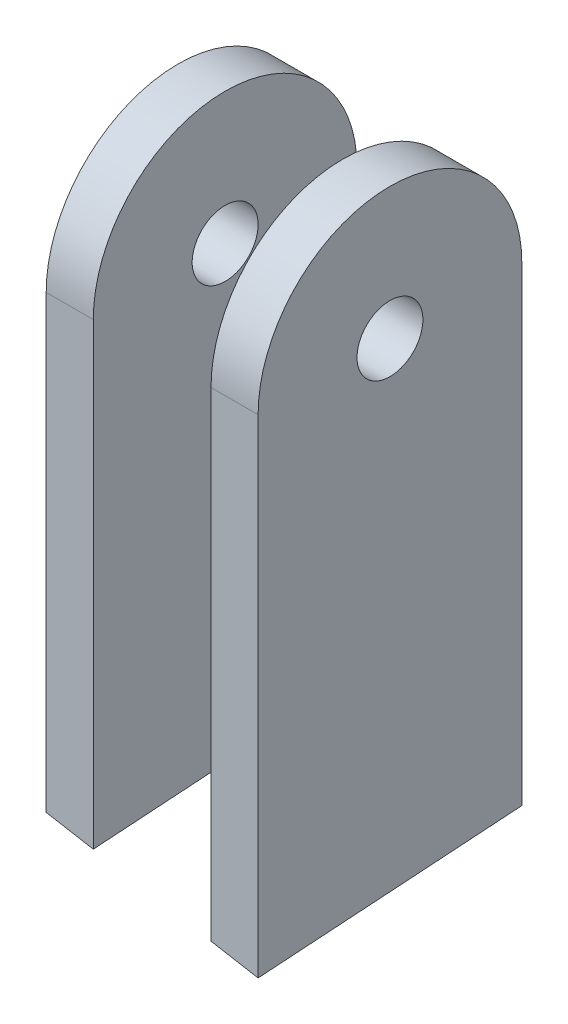
ISO-10303-21;
HEADER;
FILE_DESCRIPTION(('STEP AP214'),'2;1');
FILE_NAME('part.step','',(''),(''),'','','');
FILE_SCHEMA(('AUTOMOTIVE_DESIGN { 1 0 10303 214 1 1 1 1 }'));
ENDSEC;
DATA;
#1=APPLICATION_CONTEXT('core data for automotive mechanical design processes');
#2=APPLICATION_PROTOCOL_DEFINITION('international standard','automotive_design',2000,#1);
#3=PRODUCT_CONTEXT('',#1,'mechanical');
#4=PRODUCT('Part','Part','',(#3));
#5=PRODUCT_RELATED_PRODUCT_CATEGORY('part','',(#4));
#6=PRODUCT_DEFINITION_FORMATION('','',#4);
#7=PRODUCT_DEFINITION_CONTEXT('part definition',#1,'design');
#8=PRODUCT_DEFINITION('design','',#6,#7);
#9=PRODUCT_DEFINITION_SHAPE('','',#8);
#10=(LENGTH_UNIT() NAMED_UNIT(*) SI_UNIT(.MILLI.,.METRE.));
#11=(NAMED_UNIT(*) PLANE_ANGLE_UNIT() SI_UNIT($,.RADIAN.));
#12=(NAMED_UNIT(*) SI_UNIT($,.STERADIAN.) SOLID_ANGLE_UNIT());
#13=UNCERTAINTY_MEASURE_WITH_UNIT(LENGTH_MEASURE(1.E-05),#10,'distance_accuracy_value','');
#14=(GEOMETRIC_REPRESENTATION_CONTEXT(3) GLOBAL_UNCERTAINTY_ASSIGNED_CONTEXT((#13)) GLOBAL_UNIT_ASSIGNED_CONTEXT((#10,
#11,#12)) REPRESENTATION_CONTEXT('',''));
#15=CARTESIAN_POINT('',(0.,0.,0.));
#16=DIRECTION('',(0.,0.,1.));
#17=DIRECTION('',(1.,0.,0.));
#18=AXIS2_PLACEMENT_3D('',#15,#16,#17);
#19=CARTESIAN_POINT('',(-35.,0.,0.));
#20=DIRECTION('',(1.,0.,0.));
#21=DIRECTION('',(0.,0.,-1.));
#22=AXIS2_PLACEMENT_3D('',#19,#20,#21);
#23=CYLINDRICAL_SURFACE('',#22,28.);
#24=DIRECTION('',(1.,0.,0.));
#25=VECTOR('',#24,1.);
#26=CARTESIAN_POINT('',(-35.,0.,28.));
#27=LINE('',#26,#25);
#28=CARTESIAN_POINT('',(-35.,0.,28.));
#29=VERTEX_POINT('',#28);
#30=CARTESIAN_POINT('',(-25.,0.,28.));
#31=VERTEX_POINT('',#30);
#32=EDGE_CURVE('E111',#29,#31,#27,.T.);
#33=ORIENTED_EDGE('',*,*,#32,.T.);
#34=CARTESIAN_POINT('',(-25.,0.,0.));
#35=DIRECTION('',(1.,0.,0.));
#36=DIRECTION('',(0.,0.,-1.));
#37=AXIS2_PLACEMENT_3D('',#34,#35,#36);
#38=CIRCLE('',#37,28.);
#39=CARTESIAN_POINT('',(-25.,0.,-28.));
#40=VERTEX_POINT('',#39);
#41=EDGE_CURVE('E97',#40,#31,#38,.T.);
#42=ORIENTED_EDGE('',*,*,#41,.F.);
#43=DIRECTION('',(1.,0.,0.));
#44=VECTOR('',#43,1.);
#45=CARTESIAN_POINT('',(-35.,0.,-28.));
#46=LINE('',#45,#44);
#47=CARTESIAN_POINT('',(-35.,0.,-28.));
#48=VERTEX_POINT('',#47);
#49=EDGE_CURVE('E107',#48,#40,#46,.T.);
#50=ORIENTED_EDGE('',*,*,#49,.F.);
#51=CARTESIAN_POINT('',(-35.,0.,0.));
#52=DIRECTION('',(1.,0.,0.));
#53=DIRECTION('',(0.,0.,-1.));
#54=AXIS2_PLACEMENT_3D('',#51,#52,#53);
#55=CIRCLE('',#54,28.);
#56=EDGE_CURVE('E110',#48,#29,#55,.T.);
#57=ORIENTED_EDGE('',*,*,#56,.T.);
#58=EDGE_LOOP('',(#33,#42,#50,#57));
#59=FACE_BOUND('',#58,.T.);
#60=ADVANCED_FACE('F45',(#59),#23,.T.);
#61=CARTESIAN_POINT('',(-35.,0.,-28.));
#62=DIRECTION('',(0.,0.,-1.));
#63=DIRECTION('',(0.,1.,0.));
#64=AXIS2_PLACEMENT_3D('',#61,#62,#63);
#65=PLANE('',#64);
#66=DIRECTION('',(0.984742991627414,-0.174015058086048,0.));
#67=VECTOR('',#66,1.);
#68=CARTESIAN_POINT('',(-50.7554589790875,-89.1593979289864,-28.));
#69=LINE('',#68,#67);
#70=CARTESIAN_POINT('',(-35.,-91.9435630692605,-28.));
#71=VERTEX_POINT('',#70);
#72=CARTESIAN_POINT('',(-25.,-93.7106744837674,-28.));
#73=VERTEX_POINT('',#72);
#74=EDGE_CURVE('E59',#71,#73,#69,.T.);
#75=ORIENTED_EDGE('',*,*,#74,.F.);
#76=DIRECTION('',(0.,1.,0.));
#77=VECTOR('',#76,1.);
#78=CARTESIAN_POINT('',(-35.,0.,-28.));
#79=LINE('',#78,#77);
#80=EDGE_CURVE('E109',#71,#48,#79,.T.);
#81=ORIENTED_EDGE('',*,*,#80,.T.);
#82=ORIENTED_EDGE('',*,*,#49,.T.);
#83=DIRECTION('',(0.,1.,0.));
#84=VECTOR('',#83,1.);
#85=CARTESIAN_POINT('',(-25.,0.,-28.));
#86=LINE('',#85,#84);
#87=EDGE_CURVE('E53',#73,#40,#86,.T.);
#88=ORIENTED_EDGE('',*,*,#87,.F.);
#89=EDGE_LOOP('',(#75,#81,#82,#88));
#90=FACE_BOUND('',#89,.T.);
#91=ADVANCED_FACE('F141',(#90),#65,.T.);
#92=CARTESIAN_POINT('',(-35.,0.,28.));
#93=DIRECTION('',(0.,0.,1.));
#94=DIRECTION('',(0.,-1.,0.));
#95=AXIS2_PLACEMENT_3D('',#92,#93,#94);
#96=PLANE('',#95);
#97=DIRECTION('',(-0.984742991627414,0.174015058086048,0.));
#98=VECTOR('',#97,1.);
#99=CARTESIAN_POINT('',(-51.389250286593,-92.745992991994,28.));
#100=LINE('',#99,#98);
#101=CARTESIAN_POINT('',(-25.,-97.4092675321658,28.));
#102=VERTEX_POINT('',#101);
#103=CARTESIAN_POINT('',(-35.,-95.6421561176589,28.));
#104=VERTEX_POINT('',#103);
#105=EDGE_CURVE('E83',#102,#104,#100,.T.);
#106=ORIENTED_EDGE('',*,*,#105,.F.);
#107=DIRECTION('',(0.,-1.,0.));
#108=VECTOR('',#107,1.);
#109=CARTESIAN_POINT('',(-25.,0.,28.));
#110=LINE('',#109,#108);
#111=EDGE_CURVE('E90',#31,#102,#110,.T.);
#112=ORIENTED_EDGE('',*,*,#111,.F.);
#113=ORIENTED_EDGE('',*,*,#32,.F.);
#114=DIRECTION('',(0.,-1.,0.));
#115=VECTOR('',#114,1.);
#116=CARTESIAN_POINT('',(-35.,0.,28.));
#117=LINE('',#116,#115);
#118=EDGE_CURVE('E93',#29,#104,#117,.T.);
#119=ORIENTED_EDGE('',*,*,#118,.T.);
#120=EDGE_LOOP('',(#106,#112,#113,#119));
#121=FACE_BOUND('',#120,.T.);
#122=ADVANCED_FACE('F89',(#121),#96,.T.);
#123=CARTESIAN_POINT('',(-35.,0.,0.));
#124=DIRECTION('',(1.,0.,0.));
#125=DIRECTION('',(0.,0.,-1.));
#126=AXIS2_PLACEMENT_3D('',#123,#124,#125);
#127=CYLINDRICAL_SURFACE('',#126,7.);
#128=CARTESIAN_POINT('',(-35.,0.,0.));
#129=DIRECTION('',(1.,0.,0.));
#130=DIRECTION('',(0.,0.,-1.));
#131=AXIS2_PLACEMENT_3D('',#128,#129,#130);
#132=CIRCLE('',#131,7.);
#133=CARTESIAN_POINT('',(-35.,0.,-7.));
#134=VERTEX_POINT('',#133);
#135=EDGE_CURVE('E100',#134,#134,#132,.T.);
#136=ORIENTED_EDGE('',*,*,#135,.F.);
#137=EDGE_LOOP('',(#136));
#138=FACE_BOUND('',#137,.T.);
#139=CARTESIAN_POINT('',(-25.,0.,0.));
#140=DIRECTION('',(1.,0.,0.));
#141=DIRECTION('',(0.,0.,-1.));
#142=AXIS2_PLACEMENT_3D('',#139,#140,#141);
#143=CIRCLE('',#142,7.);
#144=CARTESIAN_POINT('',(-25.,0.,-7.));
#145=VERTEX_POINT('',#144);
#146=EDGE_CURVE('E104',#145,#145,#143,.T.);
#147=ORIENTED_EDGE('',*,*,#146,.T.);
#148=EDGE_LOOP('',(#147));
#149=FACE_BOUND('',#148,.T.);
#150=ADVANCED_FACE('F47',(#138,#149),#127,.F.);
#151=CARTESIAN_POINT('',(-35.,0.,0.));
#152=DIRECTION('',(1.,0.,0.));
#153=DIRECTION('',(0.,0.,-1.));
#154=AXIS2_PLACEMENT_3D('',#151,#152,#153);
#155=PLANE('',#154);
#156=ORIENTED_EDGE('',*,*,#135,.T.);
#157=EDGE_LOOP('',(#156));
#158=FACE_BOUND('',#157,.T.);
#159=ORIENTED_EDGE('',*,*,#80,.F.);
#160=DIRECTION('',(0.,-0.0659027232380054,0.997826052511065));
#161=VECTOR('',#160,1.);
#162=CARTESIAN_POINT('',(-35.,-93.3855013598002,-6.16776725268861));
#163=LINE('',#162,#161);
#164=EDGE_CURVE('E112',#71,#104,#163,.T.);
#165=ORIENTED_EDGE('',*,*,#164,.T.);
#166=ORIENTED_EDGE('',*,*,#118,.F.);
#167=ORIENTED_EDGE('',*,*,#56,.F.);
#168=EDGE_LOOP('',(#159,#165,#166,#167));
#169=FACE_BOUND('',#168,.T.);
#170=ADVANCED_FACE('F125',(#158,#169),#155,.F.);
#171=CARTESIAN_POINT('',(-25.,0.,0.));
#172=DIRECTION('',(1.,0.,0.));
#173=DIRECTION('',(0.,0.,-1.));
#174=AXIS2_PLACEMENT_3D('',#171,#172,#173);
#175=PLANE('',#174);
#176=DIRECTION('',(0.,-0.0659027232380054,0.997826052511065));
#177=VECTOR('',#176,1.);
#178=CARTESIAN_POINT('',(-25.,-95.1449379109154,-6.28397153477884));
#179=LINE('',#178,#177);
#180=EDGE_CURVE('E12',#73,#102,#179,.T.);
#181=ORIENTED_EDGE('',*,*,#180,.F.);
#182=ORIENTED_EDGE('',*,*,#87,.T.);
#183=ORIENTED_EDGE('',*,*,#41,.T.);
#184=ORIENTED_EDGE('',*,*,#111,.T.);
#185=EDGE_LOOP('',(#181,#182,#183,#184));
#186=FACE_BOUND('',#185,.T.);
#187=ORIENTED_EDGE('',*,*,#146,.F.);
#188=EDGE_LOOP('',(#187));
#189=FACE_BOUND('',#188,.T.);
#190=ADVANCED_FACE('F95',(#186,#189),#175,.T.);
#191=CARTESIAN_POINT('',(-17.0600336946444,-96.541924604142,-6.37623734321228));
#192=DIRECTION('',(0.173648177666932,0.982666832670463,0.0649015127894055));
#193=DIRECTION('',(-0.984742991627414,0.174015058086048,0.));
#194=AXIS2_PLACEMENT_3D('',#191,#192,#193);
#195=PLANE('',#194);
#196=ORIENTED_EDGE('',*,*,#74,.T.);
#197=ORIENTED_EDGE('',*,*,#180,.T.);
#198=ORIENTED_EDGE('',*,*,#105,.T.);
#199=ORIENTED_EDGE('',*,*,#164,.F.);
#200=EDGE_LOOP('',(#196,#197,#198,#199));
#201=FACE_BOUND('',#200,.T.);
#202=ADVANCED_FACE('F82',(#201),#195,.F.);
#203=CLOSED_SHELL('',(#60,#91,#122,#150,#170,#190,#202));
#204=MANIFOLD_SOLID_BREP('B2',#203);
#205=CARTESIAN_POINT('',(-35.,0.,28.));
#206=DIRECTION('',(0.,0.,1.));
#207=DIRECTION('',(0.,-1.,0.));
#208=AXIS2_PLACEMENT_3D('',#205,#206,#207);
#209=PLANE('',#208);
#210=DIRECTION('',(-0.984742991627414,0.174015058086048,0.));
#211=VECTOR('',#210,1.);
#212=CARTESIAN_POINT('',(-51.389250286593,-92.745992991994,28.));
#213=LINE('',#212,#211);
#214=CARTESIAN_POINT('',(10.,-103.59415748294,28.));
#215=VERTEX_POINT('',#214);
#216=CARTESIAN_POINT('',(0.,-101.827046068433,28.));
#217=VERTEX_POINT('',#216);
#218=EDGE_CURVE('E205',#215,#217,#213,.T.);
#219=ORIENTED_EDGE('',*,*,#218,.F.);
#220=DIRECTION('',(0.,-1.,0.));
#221=VECTOR('',#220,1.);
#222=CARTESIAN_POINT('',(10.,0.,28.));
#223=LINE('',#222,#221);
#224=CARTESIAN_POINT('',(10.,0.,28.));
#225=VERTEX_POINT('',#224);
#226=EDGE_CURVE('E254',#225,#215,#223,.T.);
#227=ORIENTED_EDGE('',*,*,#226,.F.);
#228=DIRECTION('',(1.,0.,0.));
#229=VECTOR('',#228,1.);
#230=CARTESIAN_POINT('',(-35.,0.,28.));
#231=LINE('',#230,#229);
#232=CARTESIAN_POINT('',(0.,0.,28.));
#233=VERTEX_POINT('',#232);
#234=EDGE_CURVE('E258',#233,#225,#231,.T.);
#235=ORIENTED_EDGE('',*,*,#234,.F.);
#236=DIRECTION('',(0.,-1.,0.));
#237=VECTOR('',#236,1.);
#238=CARTESIAN_POINT('',(0.,0.,28.));
#239=LINE('',#238,#237);
#240=EDGE_CURVE('E245',#233,#217,#239,.T.);
#241=ORIENTED_EDGE('',*,*,#240,.T.);
#242=EDGE_LOOP('',(#219,#227,#235,#241));
#243=FACE_BOUND('',#242,.T.);
#244=ADVANCED_FACE('F190',(#243),#209,.T.);
#245=CARTESIAN_POINT('',(-35.,0.,-28.));
#246=DIRECTION('',(0.,0.,-1.));
#247=DIRECTION('',(0.,1.,0.));
#248=AXIS2_PLACEMENT_3D('',#245,#246,#247);
#249=PLANE('',#248);
#250=DIRECTION('',(0.984742991627414,-0.174015058086048,0.));
#251=VECTOR('',#250,1.);
#252=CARTESIAN_POINT('',(-50.7554589790875,-89.1593979289864,-28.));
#253=LINE('',#252,#251);
#254=CARTESIAN_POINT('',(0.,-98.1284530200346,-28.));
#255=VERTEX_POINT('',#254);
#256=CARTESIAN_POINT('',(10.,-99.8955644345415,-28.));
#257=VERTEX_POINT('',#256);
#258=EDGE_CURVE('E231',#255,#257,#253,.T.);
#259=ORIENTED_EDGE('',*,*,#258,.F.);
#260=DIRECTION('',(0.,1.,0.));
#261=VECTOR('',#260,1.);
#262=CARTESIAN_POINT('',(0.,0.,-28.));
#263=LINE('',#262,#261);
#264=CARTESIAN_POINT('',(0.,0.,-28.));
#265=VERTEX_POINT('',#264);
#266=EDGE_CURVE('E237',#255,#265,#263,.T.);
#267=ORIENTED_EDGE('',*,*,#266,.T.);
#268=DIRECTION('',(1.,0.,0.));
#269=VECTOR('',#268,1.);
#270=CARTESIAN_POINT('',(-35.,0.,-28.));
#271=LINE('',#270,#269);
#272=CARTESIAN_POINT('',(10.,0.,-28.));
#273=VERTEX_POINT('',#272);
#274=EDGE_CURVE('E198',#265,#273,#271,.T.);
#275=ORIENTED_EDGE('',*,*,#274,.T.);
#276=DIRECTION('',(0.,1.,0.));
#277=VECTOR('',#276,1.);
#278=CARTESIAN_POINT('',(10.,0.,-28.));
#279=LINE('',#278,#277);
#280=EDGE_CURVE('E212',#257,#273,#279,.T.);
#281=ORIENTED_EDGE('',*,*,#280,.F.);
#282=EDGE_LOOP('',(#259,#267,#275,#281));
#283=FACE_BOUND('',#282,.T.);
#284=ADVANCED_FACE('F236',(#283),#249,.T.);
#285=CARTESIAN_POINT('',(-35.,0.,0.));
#286=DIRECTION('',(1.,0.,0.));
#287=DIRECTION('',(0.,0.,-1.));
#288=AXIS2_PLACEMENT_3D('',#285,#286,#287);
#289=CYLINDRICAL_SURFACE('',#288,28.);
#290=CARTESIAN_POINT('',(0.,0.,0.));
#291=DIRECTION('',(1.,0.,0.));
#292=DIRECTION('',(0.,0.,-1.));
#293=AXIS2_PLACEMENT_3D('',#290,#291,#292);
#294=CIRCLE('',#293,28.);
#295=EDGE_CURVE('E242',#265,#233,#294,.T.);
#296=ORIENTED_EDGE('',*,*,#295,.T.);
#297=ORIENTED_EDGE('',*,*,#234,.T.);
#298=CARTESIAN_POINT('',(10.,0.,0.));
#299=DIRECTION('',(1.,0.,0.));
#300=DIRECTION('',(0.,0.,-1.));
#301=AXIS2_PLACEMENT_3D('',#298,#299,#300);
#302=CIRCLE('',#301,28.);
#303=EDGE_CURVE('E248',#273,#225,#302,.T.);
#304=ORIENTED_EDGE('',*,*,#303,.F.);
#305=ORIENTED_EDGE('',*,*,#274,.F.);
#306=EDGE_LOOP('',(#296,#297,#304,#305));
#307=FACE_BOUND('',#306,.T.);
#308=ADVANCED_FACE('F192',(#307),#289,.T.);
#309=CARTESIAN_POINT('',(10.,0.,0.));
#310=DIRECTION('',(1.,0.,0.));
#311=DIRECTION('',(0.,0.,-1.));
#312=AXIS2_PLACEMENT_3D('',#309,#310,#311);
#313=PLANE('',#312);
#314=DIRECTION('',(0.,-0.0659027232380054,0.997826052511065));
#315=VECTOR('',#314,1.);
#316=CARTESIAN_POINT('',(10.,-101.302965839819,-6.69068652209465));
#317=LINE('',#316,#315);
#318=EDGE_CURVE('E266',#257,#215,#317,.T.);
#319=ORIENTED_EDGE('',*,*,#318,.F.);
#320=ORIENTED_EDGE('',*,*,#280,.T.);
#321=ORIENTED_EDGE('',*,*,#303,.T.);
#322=ORIENTED_EDGE('',*,*,#226,.T.);
#323=EDGE_LOOP('',(#319,#320,#321,#322));
#324=FACE_BOUND('',#323,.T.);
#325=CARTESIAN_POINT('',(10.,0.,0.));
#326=DIRECTION('',(1.,0.,0.));
#327=DIRECTION('',(0.,0.,-1.));
#328=AXIS2_PLACEMENT_3D('',#325,#326,#327);
#329=CIRCLE('',#328,7.);
#330=CARTESIAN_POINT('',(10.,0.,-7.));
#331=VERTEX_POINT('',#330);
#332=EDGE_CURVE('E244',#331,#331,#329,.T.);
#333=ORIENTED_EDGE('',*,*,#332,.F.);
#334=EDGE_LOOP('',(#333));
#335=FACE_BOUND('',#334,.T.);
#336=ADVANCED_FACE('F264',(#324,#335),#313,.T.);
#337=CARTESIAN_POINT('',(-35.,0.,0.));
#338=DIRECTION('',(1.,0.,0.));
#339=DIRECTION('',(0.,0.,-1.));
#340=AXIS2_PLACEMENT_3D('',#337,#338,#339);
#341=CYLINDRICAL_SURFACE('',#340,7.);
#342=CARTESIAN_POINT('',(0.,0.,0.));
#343=DIRECTION('',(1.,0.,0.));
#344=DIRECTION('',(0.,0.,-1.));
#345=AXIS2_PLACEMENT_3D('',#342,#343,#344);
#346=CIRCLE('',#345,7.);
#347=CARTESIAN_POINT('',(0.,0.,-7.));
#348=VERTEX_POINT('',#347);
#349=EDGE_CURVE('E328',#348,#348,#346,.T.);
#350=ORIENTED_EDGE('',*,*,#349,.F.);
#351=EDGE_LOOP('',(#350));
#352=FACE_BOUND('',#351,.T.);
#353=ORIENTED_EDGE('',*,*,#332,.T.);
#354=EDGE_LOOP('',(#353));
#355=FACE_BOUND('',#354,.T.);
#356=ADVANCED_FACE('F268',(#352,#355),#341,.F.);
#357=CARTESIAN_POINT('',(0.,0.,0.));
#358=DIRECTION('',(1.,0.,0.));
#359=DIRECTION('',(0.,0.,-1.));
#360=AXIS2_PLACEMENT_3D('',#357,#358,#359);
#361=PLANE('',#360);
#362=ORIENTED_EDGE('',*,*,#349,.T.);
#363=EDGE_LOOP('',(#362));
#364=FACE_BOUND('',#363,.T.);
#365=ORIENTED_EDGE('',*,*,#266,.F.);
#366=DIRECTION('',(0.,-0.0659027232380054,0.997826052511065));
#367=VECTOR('',#366,1.);
#368=CARTESIAN_POINT('',(0.,-99.5435292887035,-6.57448224000442));
#369=LINE('',#368,#367);
#370=EDGE_CURVE('E43',#255,#217,#369,.T.);
#371=ORIENTED_EDGE('',*,*,#370,.T.);
#372=ORIENTED_EDGE('',*,*,#240,.F.);
#373=ORIENTED_EDGE('',*,*,#295,.F.);
#374=EDGE_LOOP('',(#365,#371,#372,#373));
#375=FACE_BOUND('',#374,.T.);
#376=ADVANCED_FACE('F240',(#364,#375),#361,.F.);
#377=CARTESIAN_POINT('',(-17.0600336946444,-96.541924604142,-6.37623734321228));
#378=DIRECTION('',(0.173648177666932,0.982666832670463,0.0649015127894055));
#379=DIRECTION('',(-0.984742991627414,0.174015058086048,0.));
#380=AXIS2_PLACEMENT_3D('',#377,#378,#379);
#381=PLANE('',#380);
#382=ORIENTED_EDGE('',*,*,#318,.T.);
#383=ORIENTED_EDGE('',*,*,#218,.T.);
#384=ORIENTED_EDGE('',*,*,#370,.F.);
#385=ORIENTED_EDGE('',*,*,#258,.T.);
#386=EDGE_LOOP('',(#382,#383,#384,#385));
#387=FACE_BOUND('',#386,.T.);
#388=ADVANCED_FACE('F230',(#387),#381,.F.);
#389=CLOSED_SHELL('',(#244,#284,#308,#336,#356,#376,#388));
#390=MANIFOLD_SOLID_BREP('B6',#389);
#391=ADVANCED_BREP_SHAPE_REPRESENTATION('',(#18,#204,#390),#14);
#392=SHAPE_DEFINITION_REPRESENTATION(#9,#391);
ENDSEC;
END-ISO-10303-21;
